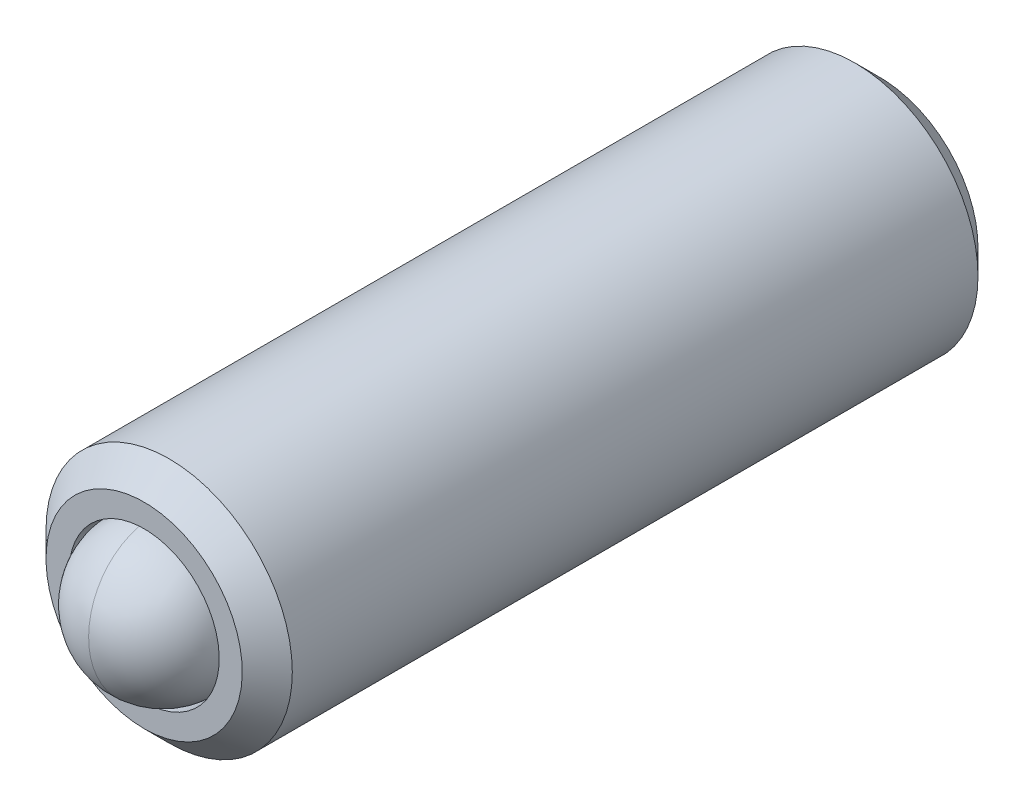
ISO-10303-21;
HEADER;
FILE_DESCRIPTION(('STEP AP214'),'2;1');
FILE_NAME('part.step','',(''),(''),'','','');
FILE_SCHEMA(('AUTOMOTIVE_DESIGN { 1 0 10303 214 1 1 1 1 }'));
ENDSEC;
DATA;
#1=APPLICATION_CONTEXT('core data for automotive mechanical design processes');
#2=APPLICATION_PROTOCOL_DEFINITION('international standard','automotive_design',2000,#1);
#3=PRODUCT_CONTEXT('',#1,'mechanical');
#4=PRODUCT('Part','Part','',(#3));
#5=PRODUCT_RELATED_PRODUCT_CATEGORY('part','',(#4));
#6=PRODUCT_DEFINITION_FORMATION('','',#4);
#7=PRODUCT_DEFINITION_CONTEXT('part definition',#1,'design');
#8=PRODUCT_DEFINITION('design','',#6,#7);
#9=PRODUCT_DEFINITION_SHAPE('','',#8);
#10=(LENGTH_UNIT() NAMED_UNIT(*) SI_UNIT(.MILLI.,.METRE.));
#11=(NAMED_UNIT(*) PLANE_ANGLE_UNIT() SI_UNIT($,.RADIAN.));
#12=(NAMED_UNIT(*) SI_UNIT($,.STERADIAN.) SOLID_ANGLE_UNIT());
#13=UNCERTAINTY_MEASURE_WITH_UNIT(LENGTH_MEASURE(1.E-05),#10,'distance_accuracy_value','');
#14=(GEOMETRIC_REPRESENTATION_CONTEXT(3) GLOBAL_UNCERTAINTY_ASSIGNED_CONTEXT((#13)) GLOBAL_UNIT_ASSIGNED_CONTEXT((#10,
#11,#12)) REPRESENTATION_CONTEXT('',''));
#15=CARTESIAN_POINT('',(0.,0.,0.));
#16=DIRECTION('',(0.,0.,1.));
#17=DIRECTION('',(1.,0.,0.));
#18=AXIS2_PLACEMENT_3D('',#15,#16,#17);
#19=CARTESIAN_POINT('',(0.,0.,3.5426));
#20=DIRECTION('',(-0.993962943693036,-0.109716300361773,0.));
#21=DIRECTION('',(-0.109716300361774,0.993962943693038,0.));
#22=AXIS2_PLACEMENT_3D('',#19,#20,#21);
#23=SPHERICAL_SURFACE('',#22,0.75);
#24=CARTESIAN_POINT('',(0.,0.,3.5426));
#25=DIRECTION('',(0.,0.,1.));
#26=DIRECTION('',(-0.109716300361774,0.993962943693038,0.));
#27=AXIS2_PLACEMENT_3D('',#24,#25,#26);
#28=CIRCLE('',#27,0.75);
#29=CARTESIAN_POINT('',(-0.0822872252713299,0.745472207769776,3.54260000000001));
#30=VERTEX_POINT('',#29);
#31=CARTESIAN_POINT('',(0.08228722527133,-0.745472207769777,3.5426));
#32=VERTEX_POINT('',#31);
#33=EDGE_CURVE('P0_E33',#30,#32,#28,.T.);
#34=ORIENTED_EDGE('',*,*,#33,.T.);
#35=CARTESIAN_POINT('',(0.,0.,3.5426));
#36=DIRECTION('',(-0.993962943693036,-0.109716300361773,0.));
#37=DIRECTION('',(0.,0.,1.));
#38=AXIS2_PLACEMENT_3D('',#35,#36,#37);
#39=CIRCLE('',#38,0.75);
#40=EDGE_CURVE('P0_E10',#32,#30,#39,.T.);
#41=ORIENTED_EDGE('',*,*,#40,.T.);
#42=EDGE_LOOP('',(#34,#41));
#43=FACE_BOUND('',#42,.T.);
#44=ADVANCED_FACE('P0_F16',(#43),#23,.T.);
#45=ORIENTED_EDGE('',*,*,#33,.F.);
#46=CARTESIAN_POINT('',(0.,0.,3.5426));
#47=DIRECTION('',(-0.993962943693036,-0.109716300361773,0.));
#48=DIRECTION('',(0.,0.,1.));
#49=AXIS2_PLACEMENT_3D('',#46,#47,#48);
#50=CIRCLE('',#49,0.75);
#51=EDGE_CURVE('P0_E23',#30,#32,#50,.T.);
#52=ORIENTED_EDGE('',*,*,#51,.T.);
#53=EDGE_LOOP('',(#45,#52));
#54=FACE_BOUND('',#53,.T.);
#55=ADVANCED_FACE('P0_F40',(#54),#23,.T.);
#56=ORIENTED_EDGE('',*,*,#40,.F.);
#57=EDGE_CURVE('P0_E36',#32,#30,#28,.T.);
#58=ORIENTED_EDGE('',*,*,#57,.T.);
#59=EDGE_LOOP('',(#56,#58));
#60=FACE_BOUND('',#59,.T.);
#61=ADVANCED_FACE('P0_F38',(#60),#23,.T.);
#62=ORIENTED_EDGE('',*,*,#51,.F.);
#63=ORIENTED_EDGE('',*,*,#57,.F.);
#64=EDGE_LOOP('',(#62,#63));
#65=FACE_BOUND('',#64,.T.);
#66=ADVANCED_FACE('P0_F18',(#65),#23,.T.);
#67=CLOSED_SHELL('',(#44,#55,#61,#66));
#68=MANIFOLD_SOLID_BREP('P0_B1',#67);
#69=CARTESIAN_POINT('',(0.,0.,-3.7338));
#70=DIRECTION('',(0.,0.,1.));
#71=DIRECTION('',(0.,-1.,0.));
#72=AXIS2_PLACEMENT_3D('',#69,#70,#71);
#73=CONICAL_SURFACE('',#72,0.995999999999999,0.785398163397452);
#74=CARTESIAN_POINT('',(0.,0.,-3.4798));
#75=DIRECTION('',(0.,0.,1.));
#76=DIRECTION('',(0.,-1.,0.));
#77=AXIS2_PLACEMENT_3D('',#74,#75,#76);
#78=CIRCLE('',#77,1.25);
#79=CARTESIAN_POINT('',(0.,-1.25,-3.4798));
#80=VERTEX_POINT('',#79);
#81=EDGE_CURVE('P1_E134',#80,#80,#78,.T.);
#82=ORIENTED_EDGE('',*,*,#81,.F.);
#83=EDGE_LOOP('',(#82));
#84=FACE_BOUND('',#83,.T.);
#85=CARTESIAN_POINT('',(0.,0.,-3.7338));
#86=DIRECTION('',(0.,0.,1.));
#87=DIRECTION('',(0.,-1.,0.));
#88=AXIS2_PLACEMENT_3D('',#85,#86,#87);
#89=CIRCLE('',#88,0.995999999999999);
#90=CARTESIAN_POINT('',(0.,-0.995999999999999,-3.7338));
#91=VERTEX_POINT('',#90);
#92=EDGE_CURVE('P1_E106',#91,#91,#89,.T.);
#93=ORIENTED_EDGE('',*,*,#92,.T.);
#94=EDGE_LOOP('',(#93));
#95=FACE_BOUND('',#94,.T.);
#96=ADVANCED_FACE('P1_F17',(#84,#95),#73,.T.);
#97=CARTESIAN_POINT('',(0.,0.,2.48193982822018));
#98=DIRECTION('',(0.,0.,1.));
#99=DIRECTION('',(0.,-1.,0.));
#100=AXIS2_PLACEMENT_3D('',#97,#98,#99);
#101=CYLINDRICAL_SURFACE('',#100,1.25);
#102=CARTESIAN_POINT('',(0.,0.,3.4798));
#103=DIRECTION('',(0.,0.,1.));
#104=DIRECTION('',(0.,-1.,0.));
#105=AXIS2_PLACEMENT_3D('',#102,#103,#104);
#106=CIRCLE('',#105,1.25);
#107=CARTESIAN_POINT('',(0.,-1.25,3.4798));
#108=VERTEX_POINT('',#107);
#109=EDGE_CURVE('P1_E131',#108,#108,#106,.T.);
#110=ORIENTED_EDGE('',*,*,#109,.F.);
#111=EDGE_LOOP('',(#110));
#112=FACE_BOUND('',#111,.T.);
#113=ORIENTED_EDGE('',*,*,#81,.T.);
#114=EDGE_LOOP('',(#113));
#115=FACE_BOUND('',#114,.T.);
#116=ADVANCED_FACE('P1_F207',(#112,#115),#101,.T.);
#117=CARTESIAN_POINT('',(0.,0.,3.4798));
#118=DIRECTION('',(0.,0.,-1.));
#119=DIRECTION('',(0.,1.,0.));
#120=AXIS2_PLACEMENT_3D('',#117,#118,#119);
#121=CONICAL_SURFACE('',#120,1.25,0.785398163397449);
#122=CARTESIAN_POINT('',(0.,0.,3.7338));
#123=DIRECTION('',(0.,0.,1.));
#124=DIRECTION('',(0.,-1.,0.));
#125=AXIS2_PLACEMENT_3D('',#122,#123,#124);
#126=CIRCLE('',#125,0.995999999999999);
#127=CARTESIAN_POINT('',(0.,-0.995999999999999,3.7338));
#128=VERTEX_POINT('',#127);
#129=EDGE_CURVE('P1_E128',#128,#128,#126,.T.);
#130=ORIENTED_EDGE('',*,*,#129,.F.);
#131=EDGE_LOOP('',(#130));
#132=FACE_BOUND('',#131,.T.);
#133=ORIENTED_EDGE('',*,*,#109,.T.);
#134=EDGE_LOOP('',(#133));
#135=FACE_BOUND('',#134,.T.);
#136=ADVANCED_FACE('P1_F212',(#132,#135),#121,.T.);
#137=CARTESIAN_POINT('',(0.,0.995999999999999,3.7338));
#138=DIRECTION('',(0.,0.,-1.));
#139=DIRECTION('',(0.,1.,0.));
#140=AXIS2_PLACEMENT_3D('',#137,#138,#139);
#141=PLANE('',#140);
#142=CARTESIAN_POINT('',(0.,0.,3.7338));
#143=DIRECTION('',(0.,0.,1.));
#144=DIRECTION('',(0.,-1.,0.));
#145=AXIS2_PLACEMENT_3D('',#142,#143,#144);
#146=CIRCLE('',#145,0.762);
#147=CARTESIAN_POINT('',(0.,-0.762,3.7338));
#148=VERTEX_POINT('',#147);
#149=EDGE_CURVE('P1_E125',#148,#148,#146,.T.);
#150=ORIENTED_EDGE('',*,*,#149,.F.);
#151=EDGE_LOOP('',(#150));
#152=FACE_BOUND('',#151,.T.);
#153=ORIENTED_EDGE('',*,*,#129,.T.);
#154=EDGE_LOOP('',(#153));
#155=FACE_BOUND('',#154,.T.);
#156=ADVANCED_FACE('P1_F287',(#152,#155),#141,.F.);
#157=CARTESIAN_POINT('',(0.,0.,2.48193982822018));
#158=DIRECTION('',(0.,0.,1.));
#159=DIRECTION('',(0.,-1.,0.));
#160=AXIS2_PLACEMENT_3D('',#157,#158,#159);
#161=CYLINDRICAL_SURFACE('',#160,0.762);
#162=CARTESIAN_POINT('',(0.,0.,3.24393982822018));
#163=DIRECTION('',(0.,0.,1.));
#164=DIRECTION('',(0.,-1.,0.));
#165=AXIS2_PLACEMENT_3D('',#162,#163,#164);
#166=CIRCLE('',#165,0.762);
#167=CARTESIAN_POINT('',(0.,-0.762,3.24393982822018));
#168=VERTEX_POINT('',#167);
#169=EDGE_CURVE('P1_E122',#168,#168,#166,.T.);
#170=ORIENTED_EDGE('',*,*,#169,.F.);
#171=EDGE_LOOP('',(#170));
#172=FACE_BOUND('',#171,.T.);
#173=ORIENTED_EDGE('',*,*,#149,.T.);
#174=EDGE_LOOP('',(#173));
#175=FACE_BOUND('',#174,.T.);
#176=ADVANCED_FACE('P1_F279',(#172,#175),#161,.F.);
#177=CARTESIAN_POINT('',(0.,0.,3.24393982822018));
#178=DIRECTION('',(0.,0.,1.));
#179=DIRECTION('',(0.,-1.,0.));
#180=AXIS2_PLACEMENT_3D('',#177,#178,#179);
#181=CONICAL_SURFACE('',#180,0.762,0.78539816339745);
#182=CARTESIAN_POINT('',(0.,0.,2.48193982822018));
#183=VERTEX_POINT('',#182);
#184=VERTEX_LOOP('',#183);
#185=FACE_BOUND('',#184,.T.);
#186=ORIENTED_EDGE('',*,*,#169,.T.);
#187=EDGE_LOOP('',(#186));
#188=FACE_BOUND('',#187,.T.);
#189=ADVANCED_FACE('P1_F158',(#185,#188),#181,.F.);
#190=CARTESIAN_POINT('',(0.,0.,-2.84479999999999));
#191=DIRECTION('',(0.,0.,-1.));
#192=DIRECTION('',(0.,1.,0.));
#193=AXIS2_PLACEMENT_3D('',#190,#191,#192);
#194=CONICAL_SURFACE('',#193,0.,0.785398163397443);
#195=CARTESIAN_POINT('',(-1.06284185255193,-0.340896089030564,-3.96097334991136));
#196=CARTESIAN_POINT('',(-1.05269009426949,-0.323312727899229,-3.94593873849999));
#197=CARTESIAN_POINT('',(-1.04247980854305,-0.305627994261237,-3.93106258143636));
#198=CARTESIAN_POINT('',(-1.02191917186862,-0.270015926905162,-3.9016914199078));
#199=CARTESIAN_POINT('',(-1.01156878467008,-0.252088530399278,-3.8871965170605));
#200=CARTESIAN_POINT('',(-0.980121869088945,-0.197620874871425,-3.84417418788951));
#201=CARTESIAN_POINT('',(-0.958783899597598,-0.160662427582056,-3.81634075681582));
#202=CARTESIAN_POINT('',(-0.914153990227386,-0.0833611570156551,-3.76202609380814));
#203=CARTESIAN_POINT('',(-0.890817989307832,-0.0429420177775138,-3.73568788169417));
#204=CARTESIAN_POINT('',(-0.843006521571837,0.0398698735256701,-3.68773934030463));
#205=CARTESIAN_POINT('',(-0.81853522578065,0.0822554011630527,-3.6661131458649));
#206=CARTESIAN_POINT('',(-0.781617664009102,0.146198493842936,-3.63967084186214));
#207=CARTESIAN_POINT('',(-0.769681255835388,0.166872959259689,-3.63202420439797));
#208=CARTESIAN_POINT('',(-0.74554242144636,0.208682646856976,-3.61864748022725));
#209=CARTESIAN_POINT('',(-0.733339975460641,0.229817903280856,-3.61291753647905));
#210=CARTESIAN_POINT('',(-0.696826902889523,0.293060400114483,-3.59926596993027));
#211=CARTESIAN_POINT('',(-0.672181427010361,0.335747616513905,-3.59455463911895));
#212=CARTESIAN_POINT('',(-0.623660560254893,0.419788222961655,-3.59505833600788));
#213=CARTESIAN_POINT('',(-0.599784245394313,0.461143213397691,-3.59997984530443));
#214=CARTESIAN_POINT('',(-0.564400968423295,0.522428846849776,-3.61351360236952));
#215=CARTESIAN_POINT('',(-0.552576501239348,0.542909424784804,-3.6191274296556));
#216=CARTESIAN_POINT('',(-0.529178820581401,0.583435396463638,-3.63215346974127));
#217=CARTESIAN_POINT('',(-0.517605580328696,0.603480836589525,-3.63956548983273));
#218=CARTESIAN_POINT('',(-0.480273693966217,0.668141560511727,-3.66621725728905));
#219=CARTESIAN_POINT('',(-0.455072713823466,0.711790938519506,-3.68856624349418));
#220=CARTESIAN_POINT('',(-0.405862678318643,0.797025220256127,-3.7381969332095));
#221=CARTESIAN_POINT('',(-0.381858422233075,0.838601811394226,-3.76549673441149));
#222=CARTESIAN_POINT('',(-0.335998726074704,0.918033135160195,-3.82175474317869));
#223=CARTESIAN_POINT('',(-0.314095933500711,0.955969884725993,-3.85056046168531));
#224=CARTESIAN_POINT('',(-0.281825896959894,1.01186322757679,-3.89506425559729));
#225=CARTESIAN_POINT('',(-0.27120895980464,1.03025230215046,-3.91005061828126));
#226=CARTESIAN_POINT('',(-0.250119387914941,1.06678051217329,-3.94041260495959));
#227=CARTESIAN_POINT('',(-0.23964671468237,1.08491971430317,-3.95578812187044));
#228=CARTESIAN_POINT('',(-0.229233994396164,1.10295507488388,-3.97132479839502));
#229=B_SPLINE_CURVE_WITH_KNOTS('',3,(#195,#196,#197,#198,#199,#200,#201,#202,#203,#204,#205,
#206,#207,#208,#209,#210,#211,#212,#213,#214,#215,#216,#217,#218,#219,#220,#221,#222,#223,#224,
#225,#226,#227,#228),.UNSPECIFIED.,.F.,.F.,(4,2,2,2,2,2,2,2,2,2,2,2,2,2,2,2,4),(0.,
0.0757901483313795,0.151600296793321,0.304377418968173,0.465006631548658,0.625086355631969,
0.700218834920009,0.775356916784001,0.922913316965699,1.06604351712323,1.13890039079435,
1.21174946001043,1.37666766413305,1.54220134519293,1.69940867215611,1.77737510369201,
1.85532030958724),.UNSPECIFIED.);
#230=CARTESIAN_POINT('',(-0.43301270189222,0.75,-3.71082540378444));
#231=VERTEX_POINT('',#230);
#232=CARTESIAN_POINT('',(-0.866025403784439,0.,-3.71082540378444));
#233=VERTEX_POINT('',#232);
#234=EDGE_CURVE('P1_E137',#231,#233,#229,.F.);
#235=ORIENTED_EDGE('',*,*,#234,.T.);
#236=CARTESIAN_POINT('',(-0.927527230740686,0.10652428904653,-3.77842422200924));
#237=CARTESIAN_POINT('',(-0.913772178504934,0.082699839713443,-3.76206025489511));
#238=CARTESIAN_POINT('',(-0.899843063224812,0.0585739043437872,-3.74623576786435));
#239=CARTESIAN_POINT('',(-0.871524518802226,0.00952474660747249,-3.71604030067918));
#240=CARTESIAN_POINT('',(-0.857133424374865,-0.0154013601172379,-3.70167560157691));
#241=CARTESIAN_POINT('',(-0.827624224318519,-0.0665127939055436,-3.6746722006709));
#242=CARTESIAN_POINT('',(-0.812497636474574,-0.0927128125964108,-3.66206986537924));
#243=CARTESIAN_POINT('',(-0.781773111348117,-0.14592925115386,-3.63956278057268));
#244=CARTESIAN_POINT('',(-0.766176025629525,-0.172944196068469,-3.62965344831461));
#245=CARTESIAN_POINT('',(-0.731564732982357,-0.232892713448999,-3.611687697844));
#246=CARTESIAN_POINT('',(-0.712456467375855,-0.265989200323981,-3.6043232082057));
#247=CARTESIAN_POINT('',(-0.674070475386426,-0.332475688748603,-3.59544798436079));
#248=CARTESIAN_POINT('',(-0.65479592005349,-0.365860197878547,-3.59388407726155));
#249=CARTESIAN_POINT('',(-0.612190477027795,-0.439654989878032,-3.59706324072552));
#250=CARTESIAN_POINT('',(-0.588883859442777,-0.48002323568786,-3.60324348561788));
#251=CARTESIAN_POINT('',(-0.554424877382654,-0.539707943393098,-3.61820009124792));
#252=CARTESIAN_POINT('',(-0.542938803937667,-0.559602406179284,-3.62419953552698));
#253=CARTESIAN_POINT('',(-0.520214179023129,-0.598962611114208,-3.6378403401495));
#254=CARTESIAN_POINT('',(-0.508975581719775,-0.618428432649425,-3.64548139359061));
#255=CARTESIAN_POINT('',(-0.470327168924469,-0.68536944724279,-3.67444968835004));
#256=CARTESIAN_POINT('',(-0.443582124607343,-0.731693222850734,-3.69930537003968));
#257=CARTESIAN_POINT('',(-0.391398877254963,-0.822077258568989,-3.7542095778083));
#258=CARTESIAN_POINT('',(-0.365966323799848,-0.866127733319461,-3.78427845883601));
#259=CARTESIAN_POINT('',(-0.31739499763223,-0.950255738032774,-3.84599848599076));
#260=CARTESIAN_POINT('',(-0.294205354920417,-0.990421377419003,-3.87749130983336));
#261=CARTESIAN_POINT('',(-0.260034635133386,-1.04960680022134,-3.92602181296099));
#262=CARTESIAN_POINT('',(-0.248793862976881,-1.06907638871271,-3.94234074239466));
#263=CARTESIAN_POINT('',(-0.226461189838472,-1.10775771325727,-3.97536923506618));
#264=CARTESIAN_POINT('',(-0.215369250011418,-1.12696951659222,-3.99207869312685));
#265=CARTESIAN_POINT('',(-0.20433855940642,-1.14607523316265,-4.00894891097708));
#266=B_SPLINE_CURVE_WITH_KNOTS('',3,(#236,#237,#238,#239,#240,#241,#242,#243,#244,#245,#246,
#247,#248,#249,#250,#251,#252,#253,#254,#255,#256,#257,#258,#259,#260,#261,#262,#263,#264,#265),
.UNSPECIFIED.,.F.,.F.,(4,2,2,2,2,2,2,2,2,2,2,2,2,2,4),(0.,0.0960560047956247,0.192509215149769,
0.29072624127093,0.388775067557685,0.505139866662251,0.620435296536788,0.760665934712406,
0.831844734482892,0.903010238785893,1.07942216349588,1.25653907400394,1.4246452266957,
1.50798251920081,1.59129762020749),.UNSPECIFIED.);
#267=CARTESIAN_POINT('',(-0.433012701892219,-0.75,-3.71082540378444));
#268=VERTEX_POINT('',#267);
#269=EDGE_CURVE('P1_E11',#233,#268,#266,.T.);
#270=ORIENTED_EDGE('',*,*,#269,.T.);
#271=CARTESIAN_POINT('',(-0.879512634058336,-0.75,-4.0006730351852));
#272=CARTESIAN_POINT('',(-0.858167311894098,-0.75,-3.98443364499877));
#273=CARTESIAN_POINT('',(-0.836704772401943,-0.75,-3.96834875335878));
#274=CARTESIAN_POINT('',(-0.793497196887177,-0.75,-3.93655223292131));
#275=CARTESIAN_POINT('',(-0.77175209340332,-0.75,-3.92084069589125));
#276=CARTESIAN_POINT('',(-0.705702416345672,-0.75,-3.87413813199126));
#277=CARTESIAN_POINT('',(-0.660907719154042,-0.75,-3.84382898984641));
#278=CARTESIAN_POINT('',(-0.566870126578343,-0.75,-3.78418100726798));
#279=CARTESIAN_POINT('',(-0.517521193746559,-0.75,-3.75500743937118));
#280=CARTESIAN_POINT('',(-0.4163415972427,-0.75,-3.70153899247777));
#281=CARTESIAN_POINT('',(-0.364520071171864,-0.75,-3.67722764871153));
#282=CARTESIAN_POINT('',(-0.286878088031127,-0.75,-3.64748323367669));
#283=CARTESIAN_POINT('',(-0.262245404960605,-0.75,-3.63897411186555));
#284=CARTESIAN_POINT('',(-0.212385087581928,-0.75,-3.62392627373799));
#285=CARTESIAN_POINT('',(-0.187157413713578,-0.75,-3.61738768884061));
#286=CARTESIAN_POINT('',(-0.111654518938835,-0.75,-3.60150722544017));
#287=CARTESIAN_POINT('',(-0.0605963901663351,-0.75,-3.59550552697601));
#288=CARTESIAN_POINT('',(0.0396610675488746,-0.75,-3.5942392443413));
#289=CARTESIAN_POINT('',(0.0888551011815962,-0.75,-3.59856441803644));
#290=CARTESIAN_POINT('',(0.161795718049164,-0.75,-3.6116627252238));
#291=CARTESIAN_POINT('',(0.18618802429241,-0.75,-3.61721329349728));
#292=CARTESIAN_POINT('',(0.234448715677603,-0.75,-3.6302491093087));
#293=CARTESIAN_POINT('',(0.258317139019203,-0.75,-3.63773421527527));
#294=CARTESIAN_POINT('',(0.332751133841371,-0.75,-3.66391424502149));
#295=CARTESIAN_POINT('',(0.382271894144945,-0.75,-3.68556285850495));
#296=CARTESIAN_POINT('',(0.478995498676066,-0.75,-3.73371383825153));
#297=CARTESIAN_POINT('',(0.526189297856767,-0.75,-3.76023350062208));
#298=CARTESIAN_POINT('',(0.61639245374929,-0.75,-3.81496699062337));
#299=CARTESIAN_POINT('',(0.659493301572126,-0.75,-3.84303195792999));
#300=CARTESIAN_POINT('',(0.722993613213674,-0.75,-3.88642638233456));
#301=CARTESIAN_POINT('',(0.743886726762691,-0.749999999999999,-3.90104592861585));
#302=CARTESIAN_POINT('',(0.785386954699469,-0.749999999999999,-3.93067404746378));
#303=CARTESIAN_POINT('',(0.805994145832291,-0.749999999999999,-3.94568251241215));
#304=CARTESIAN_POINT('',(0.826482170891556,-0.749999999999999,-3.96085231902524));
#305=B_SPLINE_CURVE_WITH_KNOTS('',3,(#271,#272,#273,#274,#275,#276,#277,#278,#279,#280,#281,
#282,#283,#284,#285,#286,#287,#288,#289,#290,#291,#292,#293,#294,#295,#296,#297,#298,#299,#300,
#301,#302,#303,#304),.UNSPECIFIED.,.F.,.F.,(4,2,2,2,2,2,2,2,2,2,2,2,2,2,2,2,4),(0.,
0.0804596117681743,0.160938799452028,0.323124453194972,0.494968571191809,0.666220542229084,
0.744331171665938,0.822447009304209,0.975597152051791,1.12276514368748,1.19774306447279,
1.27271549985278,1.43438364653409,1.59663734906442,1.75085876684989,1.82735598888851,
1.90383226465771),.UNSPECIFIED.);
#306=CARTESIAN_POINT('',(0.43301270189222,-0.75,-3.71082540378444));
#307=VERTEX_POINT('',#306);
#308=EDGE_CURVE('P1_E30',#268,#307,#305,.T.);
#309=ORIENTED_EDGE('',*,*,#308,.T.);
#310=CARTESIAN_POINT('',(0.235203453792852,-1.0926156679151,-3.96244469418937));
#311=CARTESIAN_POINT('',(0.245374454719195,-1.07499897754685,-3.94736527866085));
#312=CARTESIAN_POINT('',(0.255603988784062,-1.05728090480874,-3.93244416358874));
#313=CARTESIAN_POINT('',(0.276203174285097,-1.02160206892641,-3.90298278105357));
#314=CARTESIAN_POINT('',(0.286572861874684,-1.00364124316263,-3.8884426148147));
#315=CARTESIAN_POINT('',(0.318078139571851,-0.94907250148457,-3.84528332456332));
#316=CARTESIAN_POINT('',(0.339455323254441,-0.912046133223591,-3.81735773303345));
#317=CARTESIAN_POINT('',(0.384173472907986,-0.834592026003182,-3.76284529531596));
#318=CARTESIAN_POINT('',(0.407558827816216,-0.794087403149098,-3.73640229995302));
#319=CARTESIAN_POINT('',(0.455472853443276,-0.711097876367872,-3.68824996790749));
#320=CARTESIAN_POINT('',(0.479997337660425,-0.668620223674349,-3.66652474148943));
#321=CARTESIAN_POINT('',(0.516984689936309,-0.604556250295071,-3.63996053882712));
#322=CARTESIAN_POINT('',(0.528934614742291,-0.583858373384483,-3.63228183103672));
#323=CARTESIAN_POINT('',(0.553101651129278,-0.541999838493855,-3.61884280628643));
#324=CARTESIAN_POINT('',(0.56531878248117,-0.520839146269635,-3.613082631796));
#325=CARTESIAN_POINT('',(0.601876127050139,-0.457519968086378,-3.59934732277278));
#326=CARTESIAN_POINT('',(0.626553283872071,-0.414777878684448,-3.59458705501567));
#327=CARTESIAN_POINT('',(0.675132543200287,-0.330636133333912,-3.5950216280739));
#328=CARTESIAN_POINT('',(0.699035467095884,-0.289235054697286,-3.59991910682059));
#329=CARTESIAN_POINT('',(0.73445894161546,-0.227879797048759,-3.61343381005211));
#330=CARTESIAN_POINT('',(0.746297160563156,-0.207375400360225,-3.61904430705104));
#331=CARTESIAN_POINT('',(0.769721969920066,-0.166802440396441,-3.63206876026862));
#332=CARTESIAN_POINT('',(0.781308586842016,-0.146733831199788,-3.63948252545223));
#333=CARTESIAN_POINT('',(0.818631758723078,-0.0820882012021616,-3.66611009459973));
#334=CARTESIAN_POINT('',(0.843812221112253,-0.0384743609860332,-3.68842638019004));
#335=CARTESIAN_POINT('',(0.892982760338768,0.0466915111898482,-3.73798802591294));
#336=CARTESIAN_POINT('',(0.916968050274913,0.0882352519935222,-3.76525144867157));
#337=CARTESIAN_POINT('',(0.962792496498098,0.167605521080787,-3.82143846372039));
#338=CARTESIAN_POINT('',(0.98467892865786,0.205513933577904,-3.85020974098105));
#339=CARTESIAN_POINT('',(1.01692481702083,0.261365450557755,-3.89466196025195));
#340=CARTESIAN_POINT('',(1.0275338363026,0.27974081097226,-3.9096312677099));
#341=CARTESIAN_POINT('',(1.04860763138159,0.316241694757375,-3.93995913505665));
#342=CARTESIAN_POINT('',(1.05907244567274,0.334367284801422,-3.9553175878333));
#343=CARTESIAN_POINT('',(1.06947732364112,0.352389062089203,-3.97083720935975));
#344=B_SPLINE_CURVE_WITH_KNOTS('',3,(#310,#311,#312,#313,#314,#315,#316,#317,#318,#319,#320,
#321,#322,#323,#324,#325,#326,#327,#328,#329,#330,#331,#332,#333,#334,#335,#336,#337,#338,#339,
#340,#341,#342,#343),.UNSPECIFIED.,.F.,.F.,(4,2,2,2,2,2,2,2,2,2,2,2,2,2,2,2,4),(0.,
0.0759629355598616,0.151945855075695,0.305071277611612,0.466113127104966,0.626603862908375,
0.701842886942302,0.777087496949161,0.92484404916899,1.06812216193329,1.14105671436545,
1.21398354360363,1.37875018338922,1.54413097590977,1.70119951709445,1.77909762923883,
1.85697452800844),.UNSPECIFIED.);
#345=CARTESIAN_POINT('',(0.866025403784438,0.,-3.71082540378444));
#346=VERTEX_POINT('',#345);
#347=EDGE_CURVE('P1_E173',#307,#346,#344,.T.);
#348=ORIENTED_EDGE('',*,*,#347,.T.);
#349=CARTESIAN_POINT('',(1.09544159554944,-0.39736050021595,-4.01008436717901));
#350=CARTESIAN_POINT('',(1.0844045733579,-0.378243817015933,-3.99319279310189));
#351=CARTESIAN_POINT('',(1.07330639813563,-0.359021213659667,-3.97646161520817));
#352=CARTESIAN_POINT('',(1.05096149509295,-0.320318706299533,-3.94338877611428));
#353=CARTESIAN_POINT('',(1.03971472870617,-0.300838735496785,-3.92704721925313));
#354=CARTESIAN_POINT('',(1.00552734018977,-0.241624441608278,-3.87844820312366));
#355=CARTESIAN_POINT('',(0.982327452467547,-0.201441057343492,-3.84690768013683));
#356=CARTESIAN_POINT('',(0.933738577687017,-0.117282657541013,-3.78508498232694));
#357=CARTESIAN_POINT('',(0.908298879704534,-0.0732198081061453,-3.75496043775587));
#358=CARTESIAN_POINT('',(0.856102191770179,0.017187507382976,-3.69993011137325));
#359=CARTESIAN_POINT('',(0.829350814891473,0.0635222513093185,-3.67500414332962));
#360=CARTESIAN_POINT('',(0.790662042455872,0.130533170850249,-3.64590192692638));
#361=CARTESIAN_POINT('',(0.779389756639236,0.1500573426021,-3.63820860755069));
#362=CARTESIAN_POINT('',(0.756595752885236,0.189537715211944,-3.62446999405213));
#363=CARTESIAN_POINT('',(0.745073987576845,0.209493998118962,-3.61842501593052));
#364=CARTESIAN_POINT('',(0.710503938318051,0.269371079855352,-3.60334822450599));
#365=CARTESIAN_POINT('',(0.687118013562529,0.309876689713898,-3.59710872011173));
#366=CARTESIAN_POINT('',(0.645172858346514,0.382527829679398,-3.5939336626373));
#367=CARTESIAN_POINT('',(0.626641988405213,0.414624237926183,-3.59530536436356));
#368=CARTESIAN_POINT('',(0.589714411701281,0.47858467697779,-3.60338208850075));
#369=CARTESIAN_POINT('',(0.57132036085692,0.510444107597229,-3.6101344005395));
#370=CARTESIAN_POINT('',(0.537004452256053,0.56988100480182,-3.62719754638632));
#371=CARTESIAN_POINT('',(0.52102490740048,0.597558388373499,-3.63706354174612));
#372=CARTESIAN_POINT('',(0.489554087501413,0.652067447394533,-3.65965643886074));
#373=CARTESIAN_POINT('',(0.47406381130057,0.678897392797667,-3.67238880980683));
#374=CARTESIAN_POINT('',(0.443847832866759,0.731233002645433,-3.69977750707438));
#375=CARTESIAN_POINT('',(0.429113528857657,0.756753565803364,-3.7143966269207));
#376=CARTESIAN_POINT('',(0.400136123286777,0.806943904523658,-3.74517643881108));
#377=CARTESIAN_POINT('',(0.38589110009608,0.831617008444942,-3.76132985294923));
#378=CARTESIAN_POINT('',(0.371828512002148,0.855974125509544,-3.77804602644724));
#379=B_SPLINE_CURVE_WITH_KNOTS('',3,(#349,#350,#351,#352,#353,#354,#355,#356,#357,#358,#359,
#360,#361,#362,#363,#364,#365,#366,#367,#368,#369,#370,#371,#372,#373,#374,#375,#376,#377,#378),
.UNSPECIFIED.,.F.,.F.,(4,2,2,2,2,2,2,2,2,2,2,2,2,2,4),(0.,0.0833842105453563,0.166790505798491,
0.335028304518317,0.512267978788749,0.688806056822061,0.76021306182093,0.831633746550576,
0.972347357918454,1.08321413221605,1.19506619503666,1.29524691616736,1.39562043217188,
1.49425275961115,1.59243860158474),.UNSPECIFIED.);
#380=CARTESIAN_POINT('',(0.433012701892219,0.75,-3.71082540378444));
#381=VERTEX_POINT('',#380);
#382=EDGE_CURVE('P1_E166',#346,#381,#379,.T.);
#383=ORIENTED_EDGE('',*,*,#382,.T.);
#384=CARTESIAN_POINT('',(-0.879512634058336,0.75,-4.0006730351852));
#385=CARTESIAN_POINT('',(-0.858167311894098,0.75,-3.98443364499877));
#386=CARTESIAN_POINT('',(-0.836704772401943,0.75,-3.96834875335878));
#387=CARTESIAN_POINT('',(-0.793497196887176,0.75,-3.93655223292131));
#388=CARTESIAN_POINT('',(-0.77175209340332,0.75,-3.92084069589125));
#389=CARTESIAN_POINT('',(-0.705702416345672,0.75,-3.87413813199126));
#390=CARTESIAN_POINT('',(-0.660907719154042,0.75,-3.84382898984641));
#391=CARTESIAN_POINT('',(-0.566870126578343,0.75,-3.78418100726798));
#392=CARTESIAN_POINT('',(-0.517521193746559,0.75,-3.75500743937118));
#393=CARTESIAN_POINT('',(-0.4163415972427,0.75,-3.70153899247777));
#394=CARTESIAN_POINT('',(-0.364520071171864,0.75,-3.67722764871153));
#395=CARTESIAN_POINT('',(-0.286878088031127,0.75,-3.64748323367669));
#396=CARTESIAN_POINT('',(-0.262245404960605,0.75,-3.63897411186555));
#397=CARTESIAN_POINT('',(-0.212385087581928,0.75,-3.62392627373799));
#398=CARTESIAN_POINT('',(-0.187157413713579,0.75,-3.61738768884061));
#399=CARTESIAN_POINT('',(-0.111654518938836,0.75,-3.60150722544017));
#400=CARTESIAN_POINT('',(-0.0605963901663357,0.75,-3.59550552697601));
#401=CARTESIAN_POINT('',(0.0396610675488738,0.75,-3.5942392443413));
#402=CARTESIAN_POINT('',(0.0888551011815954,0.75,-3.59856441803644));
#403=CARTESIAN_POINT('',(0.161795718049164,0.75,-3.6116627252238));
#404=CARTESIAN_POINT('',(0.18618802429241,0.75,-3.61721329349728));
#405=CARTESIAN_POINT('',(0.234448715677602,0.75,-3.63024910930869));
#406=CARTESIAN_POINT('',(0.258317139019203,0.75,-3.63773421527527));
#407=CARTESIAN_POINT('',(0.332751133841371,0.75,-3.66391424502149));
#408=CARTESIAN_POINT('',(0.382271894144944,0.75,-3.68556285850495));
#409=CARTESIAN_POINT('',(0.478995498676065,0.75,-3.73371383825153));
#410=CARTESIAN_POINT('',(0.526189297856766,0.75,-3.76023350062208));
#411=CARTESIAN_POINT('',(0.61639245374929,0.75,-3.81496699062337));
#412=CARTESIAN_POINT('',(0.659493301572126,0.75,-3.84303195792999));
#413=CARTESIAN_POINT('',(0.722993613213674,0.75,-3.88642638233456));
#414=CARTESIAN_POINT('',(0.74388672676269,0.75,-3.90104592861585));
#415=CARTESIAN_POINT('',(0.785386954699468,0.75,-3.93067404746378));
#416=CARTESIAN_POINT('',(0.805994145832291,0.75,-3.94568251241215));
#417=CARTESIAN_POINT('',(0.826482170891555,0.75,-3.96085231902524));
#418=B_SPLINE_CURVE_WITH_KNOTS('',3,(#384,#385,#386,#387,#388,#389,#390,#391,#392,#393,#394,
#395,#396,#397,#398,#399,#400,#401,#402,#403,#404,#405,#406,#407,#408,#409,#410,#411,#412,#413,
#414,#415,#416,#417),.UNSPECIFIED.,.F.,.F.,(4,2,2,2,2,2,2,2,2,2,2,2,2,2,2,2,4),(0.,
0.0804596117681746,0.160938799452028,0.323124453194971,0.494968571191809,0.666220542229084,
0.744331171665937,0.822447009304208,0.97559715205179,1.12276514368748,1.19774306447279,
1.27271549985278,1.43438364653409,1.59663734906442,1.75085876684989,1.82735598888851,
1.90383226465771),.UNSPECIFIED.);
#419=EDGE_CURVE('P1_E144',#381,#231,#418,.F.);
#420=ORIENTED_EDGE('',*,*,#419,.T.);
#421=EDGE_LOOP('',(#235,#270,#309,#348,#383,#420));
#422=FACE_BOUND('',#421,.T.);
#423=CARTESIAN_POINT('',(0.,0.,-3.7338));
#424=DIRECTION('',(0.,0.,1.));
#425=DIRECTION('',(0.,-1.,0.));
#426=AXIS2_PLACEMENT_3D('',#423,#424,#425);
#427=CIRCLE('',#426,0.889);
#428=CARTESIAN_POINT('',(0.,-0.889,-3.7338));
#429=VERTEX_POINT('',#428);
#430=EDGE_CURVE('P1_E119',#429,#429,#427,.T.);
#431=ORIENTED_EDGE('',*,*,#430,.F.);
#432=EDGE_LOOP('',(#431));
#433=FACE_BOUND('',#432,.T.);
#434=ADVANCED_FACE('P1_F152',(#422,#433),#194,.F.);
#435=CARTESIAN_POINT('',(0.,0.889,-3.7338));
#436=DIRECTION('',(0.,0.,1.));
#437=DIRECTION('',(0.,-1.,0.));
#438=AXIS2_PLACEMENT_3D('',#435,#436,#437);
#439=PLANE('',#438);
#440=ORIENTED_EDGE('',*,*,#92,.F.);
#441=EDGE_LOOP('',(#440));
#442=FACE_BOUND('',#441,.T.);
#443=ORIENTED_EDGE('',*,*,#430,.T.);
#444=EDGE_LOOP('',(#443));
#445=FACE_BOUND('',#444,.T.);
#446=ADVANCED_FACE('P1_F157',(#442,#445),#439,.F.);
#447=CARTESIAN_POINT('',(-0.433012701892219,-0.75,-0.6858));
#448=DIRECTION('',(-0.866025403784439,-0.5,0.));
#449=DIRECTION('',(0.5,-0.866025403784439,0.));
#450=AXIS2_PLACEMENT_3D('',#447,#448,#449);
#451=PLANE('',#450);
#452=DIRECTION('',(0.,0.,-1.));
#453=VECTOR('',#452,1.);
#454=CARTESIAN_POINT('',(-0.866025403784439,0.,-0.6858));
#455=LINE('',#454,#453);
#456=CARTESIAN_POINT('',(-0.866025403784439,0.,-0.6858));
#457=VERTEX_POINT('',#456);
#458=EDGE_CURVE('P1_E37',#457,#233,#455,.T.);
#459=ORIENTED_EDGE('',*,*,#458,.F.);
#460=DIRECTION('',(-0.5,0.866025403784439,0.));
#461=VECTOR('',#460,1.);
#462=CARTESIAN_POINT('',(-0.433012701892219,-0.75,-0.6858));
#463=LINE('',#462,#461);
#464=CARTESIAN_POINT('',(-0.433012701892219,-0.75,-0.6858));
#465=VERTEX_POINT('',#464);
#466=EDGE_CURVE('P1_E77',#465,#457,#463,.T.);
#467=ORIENTED_EDGE('',*,*,#466,.F.);
#468=DIRECTION('',(0.,0.,-1.));
#469=VECTOR('',#468,1.);
#470=CARTESIAN_POINT('',(-0.433012701892219,-0.75,-0.6858));
#471=LINE('',#470,#469);
#472=EDGE_CURVE('P1_E104',#465,#268,#471,.T.);
#473=ORIENTED_EDGE('',*,*,#472,.T.);
#474=ORIENTED_EDGE('',*,*,#269,.F.);
#475=EDGE_LOOP('',(#459,#467,#473,#474));
#476=FACE_BOUND('',#475,.T.);
#477=ADVANCED_FACE('P1_F74',(#476),#451,.F.);
#478=CARTESIAN_POINT('',(0.43301270189222,-0.75,-0.6858));
#479=DIRECTION('',(0.,-1.,0.));
#480=DIRECTION('',(1.,0.,0.));
#481=AXIS2_PLACEMENT_3D('',#478,#479,#480);
#482=PLANE('',#481);
#483=ORIENTED_EDGE('',*,*,#472,.F.);
#484=DIRECTION('',(-1.,0.,0.));
#485=VECTOR('',#484,1.);
#486=CARTESIAN_POINT('',(0.43301270189222,-0.75,-0.6858));
#487=LINE('',#486,#485);
#488=CARTESIAN_POINT('',(0.43301270189222,-0.75,-0.6858));
#489=VERTEX_POINT('',#488);
#490=EDGE_CURVE('P1_E81',#489,#465,#487,.T.);
#491=ORIENTED_EDGE('',*,*,#490,.F.);
#492=DIRECTION('',(0.,0.,-1.));
#493=VECTOR('',#492,1.);
#494=CARTESIAN_POINT('',(0.43301270189222,-0.75,-0.6858));
#495=LINE('',#494,#493);
#496=EDGE_CURVE('P1_E107',#489,#307,#495,.T.);
#497=ORIENTED_EDGE('',*,*,#496,.T.);
#498=ORIENTED_EDGE('',*,*,#308,.F.);
#499=EDGE_LOOP('',(#483,#491,#497,#498));
#500=FACE_BOUND('',#499,.T.);
#501=ADVANCED_FACE('P1_F185',(#500),#482,.F.);
#502=CARTESIAN_POINT('',(0.866025403784438,0.,-0.6858));
#503=DIRECTION('',(0.866025403784439,-0.5,0.));
#504=DIRECTION('',(0.5,0.866025403784439,0.));
#505=AXIS2_PLACEMENT_3D('',#502,#503,#504);
#506=PLANE('',#505);
#507=ORIENTED_EDGE('',*,*,#496,.F.);
#508=DIRECTION('',(-0.5,-0.866025403784439,0.));
#509=VECTOR('',#508,1.);
#510=CARTESIAN_POINT('',(0.866025403784438,0.,-0.6858));
#511=LINE('',#510,#509);
#512=CARTESIAN_POINT('',(0.866025403784438,0.,-0.6858));
#513=VERTEX_POINT('',#512);
#514=EDGE_CURVE('P1_E101',#513,#489,#511,.T.);
#515=ORIENTED_EDGE('',*,*,#514,.F.);
#516=DIRECTION('',(0.,0.,-1.));
#517=VECTOR('',#516,1.);
#518=CARTESIAN_POINT('',(0.866025403784438,0.,-0.6858));
#519=LINE('',#518,#517);
#520=EDGE_CURVE('P1_E110',#513,#346,#519,.T.);
#521=ORIENTED_EDGE('',*,*,#520,.T.);
#522=ORIENTED_EDGE('',*,*,#347,.F.);
#523=EDGE_LOOP('',(#507,#515,#521,#522));
#524=FACE_BOUND('',#523,.T.);
#525=ADVANCED_FACE('P1_F189',(#524),#506,.F.);
#526=CARTESIAN_POINT('',(0.433012701892219,0.75,-0.6858));
#527=DIRECTION('',(0.866025403784438,0.5,0.));
#528=DIRECTION('',(-0.5,0.866025403784439,0.));
#529=AXIS2_PLACEMENT_3D('',#526,#527,#528);
#530=PLANE('',#529);
#531=ORIENTED_EDGE('',*,*,#520,.F.);
#532=DIRECTION('',(0.5,-0.866025403784438,0.));
#533=VECTOR('',#532,1.);
#534=CARTESIAN_POINT('',(0.433012701892219,0.75,-0.6858));
#535=LINE('',#534,#533);
#536=CARTESIAN_POINT('',(0.433012701892219,0.75,-0.6858));
#537=VERTEX_POINT('',#536);
#538=EDGE_CURVE('P1_E98',#537,#513,#535,.T.);
#539=ORIENTED_EDGE('',*,*,#538,.F.);
#540=DIRECTION('',(0.,0.,-1.));
#541=VECTOR('',#540,1.);
#542=CARTESIAN_POINT('',(0.433012701892219,0.75,-0.6858));
#543=LINE('',#542,#541);
#544=EDGE_CURVE('P1_E113',#537,#381,#543,.T.);
#545=ORIENTED_EDGE('',*,*,#544,.T.);
#546=ORIENTED_EDGE('',*,*,#382,.F.);
#547=EDGE_LOOP('',(#531,#539,#545,#546));
#548=FACE_BOUND('',#547,.T.);
#549=ADVANCED_FACE('P1_F193',(#548),#530,.F.);
#550=CARTESIAN_POINT('',(-0.43301270189222,0.75,-0.6858));
#551=DIRECTION('',(0.,1.,0.));
#552=DIRECTION('',(-1.,0.,0.));
#553=AXIS2_PLACEMENT_3D('',#550,#551,#552);
#554=PLANE('',#553);
#555=ORIENTED_EDGE('',*,*,#544,.F.);
#556=DIRECTION('',(1.,0.,0.));
#557=VECTOR('',#556,1.);
#558=CARTESIAN_POINT('',(-0.43301270189222,0.75,-0.6858));
#559=LINE('',#558,#557);
#560=CARTESIAN_POINT('',(-0.43301270189222,0.75,-0.6858));
#561=VERTEX_POINT('',#560);
#562=EDGE_CURVE('P1_E90',#561,#537,#559,.T.);
#563=ORIENTED_EDGE('',*,*,#562,.F.);
#564=DIRECTION('',(0.,0.,-1.));
#565=VECTOR('',#564,1.);
#566=CARTESIAN_POINT('',(-0.43301270189222,0.75,-0.6858));
#567=LINE('',#566,#565);
#568=EDGE_CURVE('P1_E80',#561,#231,#567,.T.);
#569=ORIENTED_EDGE('',*,*,#568,.T.);
#570=ORIENTED_EDGE('',*,*,#419,.F.);
#571=EDGE_LOOP('',(#555,#563,#569,#570));
#572=FACE_BOUND('',#571,.T.);
#573=ADVANCED_FACE('P1_F197',(#572),#554,.F.);
#574=CARTESIAN_POINT('',(-0.866025403784439,0.,-0.6858));
#575=DIRECTION('',(-0.866025403784439,0.5,0.));
#576=DIRECTION('',(-0.5,-0.866025403784439,0.));
#577=AXIS2_PLACEMENT_3D('',#574,#575,#576);
#578=PLANE('',#577);
#579=ORIENTED_EDGE('',*,*,#568,.F.);
#580=DIRECTION('',(0.5,0.866025403784439,0.));
#581=VECTOR('',#580,1.);
#582=CARTESIAN_POINT('',(-0.866025403784439,0.,-0.6858));
#583=LINE('',#582,#581);
#584=EDGE_CURVE('P1_E84',#457,#561,#583,.T.);
#585=ORIENTED_EDGE('',*,*,#584,.F.);
#586=ORIENTED_EDGE('',*,*,#458,.T.);
#587=ORIENTED_EDGE('',*,*,#234,.F.);
#588=EDGE_LOOP('',(#579,#585,#586,#587));
#589=FACE_BOUND('',#588,.T.);
#590=ADVANCED_FACE('P1_F85',(#589),#578,.F.);
#591=CARTESIAN_POINT('',(-0.866025403784439,0.,-0.6858));
#592=DIRECTION('',(0.,0.,-1.));
#593=DIRECTION('',(-1.,0.,0.));
#594=AXIS2_PLACEMENT_3D('',#591,#592,#593);
#595=PLANE('',#594);
#596=ORIENTED_EDGE('',*,*,#466,.T.);
#597=ORIENTED_EDGE('',*,*,#584,.T.);
#598=ORIENTED_EDGE('',*,*,#562,.T.);
#599=ORIENTED_EDGE('',*,*,#538,.T.);
#600=ORIENTED_EDGE('',*,*,#514,.T.);
#601=ORIENTED_EDGE('',*,*,#490,.T.);
#602=EDGE_LOOP('',(#596,#597,#598,#599,#600,#601));
#603=FACE_BOUND('',#602,.T.);
#604=ADVANCED_FACE('P1_F92',(#603),#595,.T.);
#605=CLOSED_SHELL('',(#96,#116,#136,#156,#176,#189,#434,#446,#477,#501,#525,#549,#573,#590,#604));
#606=MANIFOLD_SOLID_BREP('P1_B1',#605);
#607=ADVANCED_BREP_SHAPE_REPRESENTATION('',(#18,#68,#606),#14);
#608=SHAPE_DEFINITION_REPRESENTATION(#9,#607);
ENDSEC;
END-ISO-10303-21;
